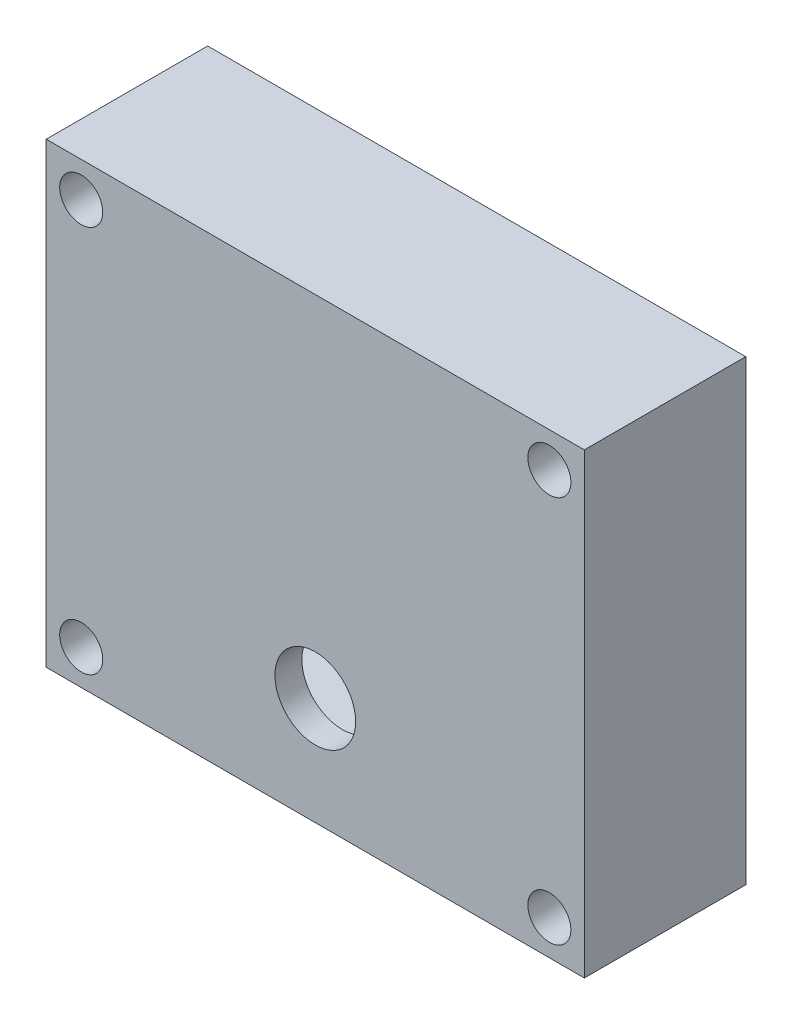
ISO-10303-21;
HEADER;
FILE_DESCRIPTION(('STEP AP214'),'2;1');
FILE_NAME('part.step','',(''),(''),'','','');
FILE_SCHEMA(('AUTOMOTIVE_DESIGN { 1 0 10303 214 1 1 1 1 }'));
ENDSEC;
DATA;
#1=APPLICATION_CONTEXT('core data for automotive mechanical design processes');
#2=APPLICATION_PROTOCOL_DEFINITION('international standard','automotive_design',2000,#1);
#3=PRODUCT_CONTEXT('',#1,'mechanical');
#4=PRODUCT('Part','Part','',(#3));
#5=PRODUCT_RELATED_PRODUCT_CATEGORY('part','',(#4));
#6=PRODUCT_DEFINITION_FORMATION('','',#4);
#7=PRODUCT_DEFINITION_CONTEXT('part definition',#1,'design');
#8=PRODUCT_DEFINITION('design','',#6,#7);
#9=PRODUCT_DEFINITION_SHAPE('','',#8);
#10=(LENGTH_UNIT() NAMED_UNIT(*) SI_UNIT(.MILLI.,.METRE.));
#11=(NAMED_UNIT(*) PLANE_ANGLE_UNIT() SI_UNIT($,.RADIAN.));
#12=(NAMED_UNIT(*) SI_UNIT($,.STERADIAN.) SOLID_ANGLE_UNIT());
#13=UNCERTAINTY_MEASURE_WITH_UNIT(LENGTH_MEASURE(1.E-05),#10,'distance_accuracy_value','');
#14=(GEOMETRIC_REPRESENTATION_CONTEXT(3) GLOBAL_UNCERTAINTY_ASSIGNED_CONTEXT((#13)) GLOBAL_UNIT_ASSIGNED_CONTEXT((#10,
#11,#12)) REPRESENTATION_CONTEXT('',''));
#15=CARTESIAN_POINT('',(0.,0.,0.));
#16=DIRECTION('',(0.,0.,1.));
#17=DIRECTION('',(1.,0.,0.));
#18=AXIS2_PLACEMENT_3D('',#15,#16,#17);
#19=CARTESIAN_POINT('',(-43.5,36.,-20.));
#20=DIRECTION('',(0.,0.,1.));
#21=DIRECTION('',(1.,0.,0.));
#22=AXIS2_PLACEMENT_3D('',#19,#20,#21);
#23=CYLINDRICAL_SURFACE('',#22,2.5);
#24=CARTESIAN_POINT('',(-43.5,36.,0.));
#25=DIRECTION('',(0.,0.,1.));
#26=DIRECTION('',(1.,0.,0.));
#27=AXIS2_PLACEMENT_3D('',#24,#25,#26);
#28=CIRCLE('',#27,2.5);
#29=CARTESIAN_POINT('',(-41.,36.,0.));
#30=VERTEX_POINT('',#29);
#31=EDGE_CURVE('E252',#30,#30,#28,.T.);
#32=ORIENTED_EDGE('',*,*,#31,.F.);
#33=EDGE_LOOP('',(#32));
#34=FACE_BOUND('',#33,.T.);
#35=CARTESIAN_POINT('',(-43.5,36.,10.));
#36=DIRECTION('',(0.,0.,1.));
#37=DIRECTION('',(1.,0.,0.));
#38=AXIS2_PLACEMENT_3D('',#35,#36,#37);
#39=CIRCLE('',#38,2.5);
#40=CARTESIAN_POINT('',(-41.,36.,10.));
#41=VERTEX_POINT('',#40);
#42=EDGE_CURVE('E256',#41,#41,#39,.F.);
#43=ORIENTED_EDGE('',*,*,#42,.F.);
#44=EDGE_LOOP('',(#43));
#45=FACE_BOUND('',#44,.T.);
#46=ADVANCED_FACE('F34',(#34,#45),#23,.F.);
#47=CARTESIAN_POINT('',(43.5,36.,-20.));
#48=DIRECTION('',(0.,0.,1.));
#49=DIRECTION('',(1.,0.,0.));
#50=AXIS2_PLACEMENT_3D('',#47,#48,#49);
#51=CYLINDRICAL_SURFACE('',#50,2.5);
#52=CARTESIAN_POINT('',(43.5,36.,0.));
#53=DIRECTION('',(0.,0.,1.));
#54=DIRECTION('',(1.,0.,0.));
#55=AXIS2_PLACEMENT_3D('',#52,#53,#54);
#56=CIRCLE('',#55,2.5);
#57=CARTESIAN_POINT('',(46.,36.,0.));
#58=VERTEX_POINT('',#57);
#59=EDGE_CURVE('E255',#58,#58,#56,.T.);
#60=ORIENTED_EDGE('',*,*,#59,.F.);
#61=EDGE_LOOP('',(#60));
#62=FACE_BOUND('',#61,.T.);
#63=CARTESIAN_POINT('',(43.5,36.,10.));
#64=DIRECTION('',(0.,0.,1.));
#65=DIRECTION('',(1.,0.,0.));
#66=AXIS2_PLACEMENT_3D('',#63,#64,#65);
#67=CIRCLE('',#66,2.5);
#68=CARTESIAN_POINT('',(46.,36.,10.));
#69=VERTEX_POINT('',#68);
#70=EDGE_CURVE('E269',#69,#69,#67,.F.);
#71=ORIENTED_EDGE('',*,*,#70,.F.);
#72=EDGE_LOOP('',(#71));
#73=FACE_BOUND('',#72,.T.);
#74=ADVANCED_FACE('F277',(#62,#73),#51,.F.);
#75=CARTESIAN_POINT('',(43.5,-36.,-20.));
#76=DIRECTION('',(0.,0.,1.));
#77=DIRECTION('',(1.,0.,0.));
#78=AXIS2_PLACEMENT_3D('',#75,#76,#77);
#79=CYLINDRICAL_SURFACE('',#78,2.5);
#80=CARTESIAN_POINT('',(43.5,-36.,0.));
#81=DIRECTION('',(0.,0.,1.));
#82=DIRECTION('',(1.,0.,0.));
#83=AXIS2_PLACEMENT_3D('',#80,#81,#82);
#84=CIRCLE('',#83,2.5);
#85=CARTESIAN_POINT('',(46.,-36.,0.));
#86=VERTEX_POINT('',#85);
#87=EDGE_CURVE('E259',#86,#86,#84,.T.);
#88=ORIENTED_EDGE('',*,*,#87,.F.);
#89=EDGE_LOOP('',(#88));
#90=FACE_BOUND('',#89,.T.);
#91=CARTESIAN_POINT('',(43.5,-36.,10.));
#92=DIRECTION('',(0.,0.,1.));
#93=DIRECTION('',(1.,0.,0.));
#94=AXIS2_PLACEMENT_3D('',#91,#92,#93);
#95=CIRCLE('',#94,2.5);
#96=CARTESIAN_POINT('',(46.,-36.,10.));
#97=VERTEX_POINT('',#96);
#98=EDGE_CURVE('E266',#97,#97,#95,.F.);
#99=ORIENTED_EDGE('',*,*,#98,.F.);
#100=EDGE_LOOP('',(#99));
#101=FACE_BOUND('',#100,.T.);
#102=ADVANCED_FACE('F283',(#90,#101),#79,.F.);
#103=CARTESIAN_POINT('',(-43.5,-36.,-20.));
#104=DIRECTION('',(0.,0.,1.));
#105=DIRECTION('',(1.,0.,0.));
#106=AXIS2_PLACEMENT_3D('',#103,#104,#105);
#107=CYLINDRICAL_SURFACE('',#106,2.5);
#108=CARTESIAN_POINT('',(-43.5,-36.,0.));
#109=DIRECTION('',(0.,0.,1.));
#110=DIRECTION('',(1.,0.,0.));
#111=AXIS2_PLACEMENT_3D('',#108,#109,#110);
#112=CIRCLE('',#111,2.5);
#113=CARTESIAN_POINT('',(-41.,-36.,0.));
#114=VERTEX_POINT('',#113);
#115=EDGE_CURVE('E242',#114,#114,#112,.T.);
#116=ORIENTED_EDGE('',*,*,#115,.F.);
#117=EDGE_LOOP('',(#116));
#118=FACE_BOUND('',#117,.T.);
#119=CARTESIAN_POINT('',(-43.5,-36.,10.));
#120=DIRECTION('',(0.,0.,1.));
#121=DIRECTION('',(1.,0.,0.));
#122=AXIS2_PLACEMENT_3D('',#119,#120,#121);
#123=CIRCLE('',#122,2.5);
#124=CARTESIAN_POINT('',(-41.,-36.,10.));
#125=VERTEX_POINT('',#124);
#126=EDGE_CURVE('E228',#125,#125,#123,.F.);
#127=ORIENTED_EDGE('',*,*,#126,.F.);
#128=EDGE_LOOP('',(#127));
#129=FACE_BOUND('',#128,.T.);
#130=ADVANCED_FACE('F289',(#118,#129),#107,.F.);
#131=CARTESIAN_POINT('',(50.,42.5,30.));
#132=DIRECTION('',(-1.,0.,0.));
#133=DIRECTION('',(0.,-1.,0.));
#134=AXIS2_PLACEMENT_3D('',#131,#132,#133);
#135=PLANE('',#134);
#136=DIRECTION('',(0.,1.,0.));
#137=VECTOR('',#136,1.);
#138=CARTESIAN_POINT('',(50.,42.5,0.));
#139=LINE('',#138,#137);
#140=CARTESIAN_POINT('',(50.,-42.5,0.));
#141=VERTEX_POINT('',#140);
#142=CARTESIAN_POINT('',(50.,42.5,0.));
#143=VERTEX_POINT('',#142);
#144=EDGE_CURVE('E238',#141,#143,#139,.T.);
#145=ORIENTED_EDGE('',*,*,#144,.T.);
#146=DIRECTION('',(0.,0.,-1.));
#147=VECTOR('',#146,1.);
#148=CARTESIAN_POINT('',(50.,42.5,30.));
#149=LINE('',#148,#147);
#150=CARTESIAN_POINT('',(50.,42.5,30.));
#151=VERTEX_POINT('',#150);
#152=EDGE_CURVE('E11',#151,#143,#149,.T.);
#153=ORIENTED_EDGE('',*,*,#152,.F.);
#154=DIRECTION('',(0.,1.,0.));
#155=VECTOR('',#154,1.);
#156=CARTESIAN_POINT('',(50.,42.5,30.));
#157=LINE('',#156,#155);
#158=CARTESIAN_POINT('',(50.,-42.5,30.));
#159=VERTEX_POINT('',#158);
#160=EDGE_CURVE('E231',#159,#151,#157,.T.);
#161=ORIENTED_EDGE('',*,*,#160,.F.);
#162=DIRECTION('',(0.,0.,-1.));
#163=VECTOR('',#162,1.);
#164=CARTESIAN_POINT('',(50.,-42.5,30.));
#165=LINE('',#164,#163);
#166=EDGE_CURVE('E237',#159,#141,#165,.T.);
#167=ORIENTED_EDGE('',*,*,#166,.T.);
#168=EDGE_LOOP('',(#145,#153,#161,#167));
#169=FACE_BOUND('',#168,.T.);
#170=ADVANCED_FACE('F36',(#169),#135,.F.);
#171=CARTESIAN_POINT('',(-50.,42.5,30.));
#172=DIRECTION('',(0.,-1.,0.));
#173=DIRECTION('',(0.,0.,-1.));
#174=AXIS2_PLACEMENT_3D('',#171,#172,#173);
#175=PLANE('',#174);
#176=DIRECTION('',(-1.,0.,0.));
#177=VECTOR('',#176,1.);
#178=CARTESIAN_POINT('',(-50.,42.5,0.));
#179=LINE('',#178,#177);
#180=CARTESIAN_POINT('',(-50.,42.5,0.));
#181=VERTEX_POINT('',#180);
#182=EDGE_CURVE('E241',#143,#181,#179,.T.);
#183=ORIENTED_EDGE('',*,*,#182,.T.);
#184=DIRECTION('',(0.,0.,-1.));
#185=VECTOR('',#184,1.);
#186=CARTESIAN_POINT('',(-50.,42.5,30.));
#187=LINE('',#186,#185);
#188=CARTESIAN_POINT('',(-50.,42.5,30.));
#189=VERTEX_POINT('',#188);
#190=EDGE_CURVE('E43',#189,#181,#187,.T.);
#191=ORIENTED_EDGE('',*,*,#190,.F.);
#192=DIRECTION('',(-1.,0.,0.));
#193=VECTOR('',#192,1.);
#194=CARTESIAN_POINT('',(-50.,42.5,30.));
#195=LINE('',#194,#193);
#196=EDGE_CURVE('E88',#151,#189,#195,.T.);
#197=ORIENTED_EDGE('',*,*,#196,.F.);
#198=ORIENTED_EDGE('',*,*,#152,.T.);
#199=EDGE_LOOP('',(#183,#191,#197,#198));
#200=FACE_BOUND('',#199,.T.);
#201=ADVANCED_FACE('F305',(#200),#175,.F.);
#202=CARTESIAN_POINT('',(-50.,42.5,30.));
#203=DIRECTION('',(1.,0.,0.));
#204=DIRECTION('',(0.,1.,0.));
#205=AXIS2_PLACEMENT_3D('',#202,#203,#204);
#206=PLANE('',#205);
#207=DIRECTION('',(0.,-1.,0.));
#208=VECTOR('',#207,1.);
#209=CARTESIAN_POINT('',(-50.,42.5,0.));
#210=LINE('',#209,#208);
#211=CARTESIAN_POINT('',(-50.,-42.5,0.));
#212=VERTEX_POINT('',#211);
#213=EDGE_CURVE('E244',#181,#212,#210,.T.);
#214=ORIENTED_EDGE('',*,*,#213,.T.);
#215=DIRECTION('',(0.,0.,-1.));
#216=VECTOR('',#215,1.);
#217=CARTESIAN_POINT('',(-50.,-42.5,30.));
#218=LINE('',#217,#216);
#219=CARTESIAN_POINT('',(-50.,-42.5,30.));
#220=VERTEX_POINT('',#219);
#221=EDGE_CURVE('E248',#220,#212,#218,.T.);
#222=ORIENTED_EDGE('',*,*,#221,.F.);
#223=DIRECTION('',(0.,-1.,0.));
#224=VECTOR('',#223,1.);
#225=CARTESIAN_POINT('',(-50.,42.5,30.));
#226=LINE('',#225,#224);
#227=EDGE_CURVE('E234',#189,#220,#226,.T.);
#228=ORIENTED_EDGE('',*,*,#227,.F.);
#229=ORIENTED_EDGE('',*,*,#190,.T.);
#230=EDGE_LOOP('',(#214,#222,#228,#229));
#231=FACE_BOUND('',#230,.T.);
#232=ADVANCED_FACE('F303',(#231),#206,.F.);
#233=CARTESIAN_POINT('',(-50.,-42.5,30.));
#234=DIRECTION('',(0.,1.,0.));
#235=DIRECTION('',(0.,0.,1.));
#236=AXIS2_PLACEMENT_3D('',#233,#234,#235);
#237=PLANE('',#236);
#238=DIRECTION('',(1.,0.,0.));
#239=VECTOR('',#238,1.);
#240=CARTESIAN_POINT('',(-50.,-42.5,0.));
#241=LINE('',#240,#239);
#242=EDGE_CURVE('E81',#212,#141,#241,.T.);
#243=ORIENTED_EDGE('',*,*,#242,.T.);
#244=ORIENTED_EDGE('',*,*,#166,.F.);
#245=DIRECTION('',(1.,0.,0.));
#246=VECTOR('',#245,1.);
#247=CARTESIAN_POINT('',(-50.,-42.5,30.));
#248=LINE('',#247,#246);
#249=EDGE_CURVE('E60',#220,#159,#248,.T.);
#250=ORIENTED_EDGE('',*,*,#249,.F.);
#251=ORIENTED_EDGE('',*,*,#221,.T.);
#252=EDGE_LOOP('',(#243,#244,#250,#251));
#253=FACE_BOUND('',#252,.T.);
#254=ADVANCED_FACE('F295',(#253),#237,.F.);
#255=CARTESIAN_POINT('',(0.,0.,30.));
#256=DIRECTION('',(0.,0.,1.));
#257=DIRECTION('',(1.,0.,0.));
#258=AXIS2_PLACEMENT_3D('',#255,#256,#257);
#259=PLANE('',#258);
#260=CARTESIAN_POINT('',(0.,-22.5,30.));
#261=DIRECTION('',(0.,0.,1.));
#262=DIRECTION('',(1.,0.,0.));
#263=AXIS2_PLACEMENT_3D('',#260,#261,#262);
#264=CIRCLE('',#263,7.5);
#265=CARTESIAN_POINT('',(7.50000000000001,-22.5,30.));
#266=VERTEX_POINT('',#265);
#267=EDGE_CURVE('E161',#266,#266,#264,.T.);
#268=ORIENTED_EDGE('',*,*,#267,.F.);
#269=EDGE_LOOP('',(#268));
#270=FACE_BOUND('',#269,.T.);
#271=CARTESIAN_POINT('',(43.5,36.,30.));
#272=DIRECTION('',(0.,0.,1.));
#273=DIRECTION('',(1.,0.,0.));
#274=AXIS2_PLACEMENT_3D('',#271,#272,#273);
#275=CIRCLE('',#274,4.);
#276=CARTESIAN_POINT('',(47.5,36.,30.));
#277=VERTEX_POINT('',#276);
#278=EDGE_CURVE('E217',#277,#277,#275,.T.);
#279=ORIENTED_EDGE('',*,*,#278,.F.);
#280=EDGE_LOOP('',(#279));
#281=FACE_BOUND('',#280,.T.);
#282=CARTESIAN_POINT('',(-43.5,-36.,30.));
#283=DIRECTION('',(0.,0.,1.));
#284=DIRECTION('',(1.,0.,0.));
#285=AXIS2_PLACEMENT_3D('',#282,#283,#284);
#286=CIRCLE('',#285,4.);
#287=CARTESIAN_POINT('',(-39.5,-36.,30.));
#288=VERTEX_POINT('',#287);
#289=EDGE_CURVE('E210',#288,#288,#286,.T.);
#290=ORIENTED_EDGE('',*,*,#289,.F.);
#291=EDGE_LOOP('',(#290));
#292=FACE_BOUND('',#291,.T.);
#293=CARTESIAN_POINT('',(43.5,-36.,30.));
#294=DIRECTION('',(0.,0.,1.));
#295=DIRECTION('',(1.,0.,0.));
#296=AXIS2_PLACEMENT_3D('',#293,#294,#295);
#297=CIRCLE('',#296,4.);
#298=CARTESIAN_POINT('',(47.5,-36.,30.));
#299=VERTEX_POINT('',#298);
#300=EDGE_CURVE('E195',#299,#299,#297,.T.);
#301=ORIENTED_EDGE('',*,*,#300,.F.);
#302=EDGE_LOOP('',(#301));
#303=FACE_BOUND('',#302,.T.);
#304=CARTESIAN_POINT('',(-43.5,36.,30.));
#305=DIRECTION('',(0.,0.,1.));
#306=DIRECTION('',(1.,0.,0.));
#307=AXIS2_PLACEMENT_3D('',#304,#305,#306);
#308=CIRCLE('',#307,4.);
#309=CARTESIAN_POINT('',(-39.5,36.,30.));
#310=VERTEX_POINT('',#309);
#311=EDGE_CURVE('E216',#310,#310,#308,.T.);
#312=ORIENTED_EDGE('',*,*,#311,.F.);
#313=EDGE_LOOP('',(#312));
#314=FACE_BOUND('',#313,.T.);
#315=ORIENTED_EDGE('',*,*,#160,.T.);
#316=ORIENTED_EDGE('',*,*,#196,.T.);
#317=ORIENTED_EDGE('',*,*,#227,.T.);
#318=ORIENTED_EDGE('',*,*,#249,.T.);
#319=EDGE_LOOP('',(#315,#316,#317,#318));
#320=FACE_BOUND('',#319,.T.);
#321=ADVANCED_FACE('F291',(#270,#281,#292,#303,#314,#320),#259,.T.);
#322=CARTESIAN_POINT('',(0.,0.,0.));
#323=DIRECTION('',(0.,0.,1.));
#324=DIRECTION('',(1.,0.,0.));
#325=AXIS2_PLACEMENT_3D('',#322,#323,#324);
#326=PLANE('',#325);
#327=DIRECTION('',(-1.,0.,0.));
#328=VECTOR('',#327,1.);
#329=CARTESIAN_POINT('',(32.,-37.,0.));
#330=LINE('',#329,#328);
#331=CARTESIAN_POINT('',(32.,-37.,0.));
#332=VERTEX_POINT('',#331);
#333=CARTESIAN_POINT('',(-32.,-37.,0.));
#334=VERTEX_POINT('',#333);
#335=EDGE_CURVE('E177',#332,#334,#330,.T.);
#336=ORIENTED_EDGE('',*,*,#335,.F.);
#337=CARTESIAN_POINT('',(32.,-27.,0.));
#338=DIRECTION('',(0.,0.,-1.));
#339=DIRECTION('',(-1.,0.,0.));
#340=AXIS2_PLACEMENT_3D('',#337,#338,#339);
#341=CIRCLE('',#340,10.);
#342=CARTESIAN_POINT('',(42.,-27.,0.));
#343=VERTEX_POINT('',#342);
#344=EDGE_CURVE('E51',#343,#332,#341,.T.);
#345=ORIENTED_EDGE('',*,*,#344,.F.);
#346=DIRECTION('',(0.,-1.,0.));
#347=VECTOR('',#346,1.);
#348=CARTESIAN_POINT('',(42.,27.,0.));
#349=LINE('',#348,#347);
#350=CARTESIAN_POINT('',(42.,27.,0.));
#351=VERTEX_POINT('',#350);
#352=EDGE_CURVE('E155',#351,#343,#349,.T.);
#353=ORIENTED_EDGE('',*,*,#352,.F.);
#354=CARTESIAN_POINT('',(32.,27.,0.));
#355=DIRECTION('',(0.,0.,-1.));
#356=DIRECTION('',(-1.,0.,0.));
#357=AXIS2_PLACEMENT_3D('',#354,#355,#356);
#358=CIRCLE('',#357,10.);
#359=CARTESIAN_POINT('',(32.,37.,0.));
#360=VERTEX_POINT('',#359);
#361=EDGE_CURVE('E158',#360,#351,#358,.T.);
#362=ORIENTED_EDGE('',*,*,#361,.F.);
#363=DIRECTION('',(1.,0.,0.));
#364=VECTOR('',#363,1.);
#365=CARTESIAN_POINT('',(32.,37.,0.));
#366=LINE('',#365,#364);
#367=CARTESIAN_POINT('',(-32.,37.,0.));
#368=VERTEX_POINT('',#367);
#369=EDGE_CURVE('E188',#368,#360,#366,.T.);
#370=ORIENTED_EDGE('',*,*,#369,.F.);
#371=CARTESIAN_POINT('',(-32.,27.,0.));
#372=DIRECTION('',(0.,0.,-1.));
#373=DIRECTION('',(1.,0.,0.));
#374=AXIS2_PLACEMENT_3D('',#371,#372,#373);
#375=CIRCLE('',#374,10.);
#376=CARTESIAN_POINT('',(-42.,27.,0.));
#377=VERTEX_POINT('',#376);
#378=EDGE_CURVE('E185',#377,#368,#375,.T.);
#379=ORIENTED_EDGE('',*,*,#378,.F.);
#380=DIRECTION('',(0.,1.,0.));
#381=VECTOR('',#380,1.);
#382=CARTESIAN_POINT('',(-42.,27.,0.));
#383=LINE('',#382,#381);
#384=CARTESIAN_POINT('',(-42.,-27.,0.));
#385=VERTEX_POINT('',#384);
#386=EDGE_CURVE('E182',#385,#377,#383,.T.);
#387=ORIENTED_EDGE('',*,*,#386,.F.);
#388=CARTESIAN_POINT('',(-32.,-27.,0.));
#389=DIRECTION('',(0.,0.,-1.));
#390=DIRECTION('',(-1.,0.,0.));
#391=AXIS2_PLACEMENT_3D('',#388,#389,#390);
#392=CIRCLE('',#391,10.);
#393=EDGE_CURVE('E179',#334,#385,#392,.T.);
#394=ORIENTED_EDGE('',*,*,#393,.F.);
#395=EDGE_LOOP('',(#336,#345,#353,#362,#370,#379,#387,#394));
#396=FACE_BOUND('',#395,.T.);
#397=ORIENTED_EDGE('',*,*,#115,.T.);
#398=EDGE_LOOP('',(#397));
#399=FACE_BOUND('',#398,.T.);
#400=ORIENTED_EDGE('',*,*,#87,.T.);
#401=EDGE_LOOP('',(#400));
#402=FACE_BOUND('',#401,.T.);
#403=ORIENTED_EDGE('',*,*,#59,.T.);
#404=EDGE_LOOP('',(#403));
#405=FACE_BOUND('',#404,.T.);
#406=ORIENTED_EDGE('',*,*,#31,.T.);
#407=EDGE_LOOP('',(#406));
#408=FACE_BOUND('',#407,.T.);
#409=ORIENTED_EDGE('',*,*,#144,.F.);
#410=ORIENTED_EDGE('',*,*,#242,.F.);
#411=ORIENTED_EDGE('',*,*,#213,.F.);
#412=ORIENTED_EDGE('',*,*,#182,.F.);
#413=EDGE_LOOP('',(#409,#410,#411,#412));
#414=FACE_BOUND('',#413,.T.);
#415=ADVANCED_FACE('F294',(#396,#399,#402,#405,#408,#414),#326,.F.);
#416=CARTESIAN_POINT('',(-43.5,-36.,10.));
#417=DIRECTION('',(0.,0.,1.));
#418=DIRECTION('',(1.,0.,0.));
#419=AXIS2_PLACEMENT_3D('',#416,#417,#418);
#420=PLANE('',#419);
#421=CARTESIAN_POINT('',(-43.5,-36.,10.));
#422=DIRECTION('',(0.,0.,1.));
#423=DIRECTION('',(1.,0.,0.));
#424=AXIS2_PLACEMENT_3D('',#421,#422,#423);
#425=CIRCLE('',#424,4.);
#426=CARTESIAN_POINT('',(-39.5,-36.,10.));
#427=VERTEX_POINT('',#426);
#428=EDGE_CURVE('E220',#427,#427,#425,.T.);
#429=ORIENTED_EDGE('',*,*,#428,.T.);
#430=EDGE_LOOP('',(#429));
#431=FACE_BOUND('',#430,.T.);
#432=ORIENTED_EDGE('',*,*,#126,.T.);
#433=EDGE_LOOP('',(#432));
#434=FACE_BOUND('',#433,.T.);
#435=ADVANCED_FACE('F299',(#431,#434),#420,.T.);
#436=CARTESIAN_POINT('',(-43.5,-36.,10.));
#437=DIRECTION('',(0.,0.,1.));
#438=DIRECTION('',(1.,0.,0.));
#439=AXIS2_PLACEMENT_3D('',#436,#437,#438);
#440=CYLINDRICAL_SURFACE('',#439,4.);
#441=ORIENTED_EDGE('',*,*,#428,.F.);
#442=EDGE_LOOP('',(#441));
#443=FACE_BOUND('',#442,.T.);
#444=ORIENTED_EDGE('',*,*,#289,.T.);
#445=EDGE_LOOP('',(#444));
#446=FACE_BOUND('',#445,.T.);
#447=ADVANCED_FACE('F332',(#443,#446),#440,.F.);
#448=CARTESIAN_POINT('',(43.5,-36.,10.));
#449=DIRECTION('',(0.,0.,1.));
#450=DIRECTION('',(1.,0.,0.));
#451=AXIS2_PLACEMENT_3D('',#448,#449,#450);
#452=PLANE('',#451);
#453=CARTESIAN_POINT('',(43.5,-36.,10.));
#454=DIRECTION('',(0.,0.,1.));
#455=DIRECTION('',(1.,0.,0.));
#456=AXIS2_PLACEMENT_3D('',#453,#454,#455);
#457=CIRCLE('',#456,4.);
#458=CARTESIAN_POINT('',(47.5,-36.,10.));
#459=VERTEX_POINT('',#458);
#460=EDGE_CURVE('E207',#459,#459,#457,.T.);
#461=ORIENTED_EDGE('',*,*,#460,.T.);
#462=EDGE_LOOP('',(#461));
#463=FACE_BOUND('',#462,.T.);
#464=ORIENTED_EDGE('',*,*,#98,.T.);
#465=EDGE_LOOP('',(#464));
#466=FACE_BOUND('',#465,.T.);
#467=ADVANCED_FACE('F338',(#463,#466),#452,.T.);
#468=CARTESIAN_POINT('',(43.5,-36.,10.));
#469=DIRECTION('',(0.,0.,1.));
#470=DIRECTION('',(1.,0.,0.));
#471=AXIS2_PLACEMENT_3D('',#468,#469,#470);
#472=CYLINDRICAL_SURFACE('',#471,4.);
#473=ORIENTED_EDGE('',*,*,#460,.F.);
#474=EDGE_LOOP('',(#473));
#475=FACE_BOUND('',#474,.T.);
#476=ORIENTED_EDGE('',*,*,#300,.T.);
#477=EDGE_LOOP('',(#476));
#478=FACE_BOUND('',#477,.T.);
#479=ADVANCED_FACE('F371',(#475,#478),#472,.F.);
#480=CARTESIAN_POINT('',(43.5,36.,10.));
#481=DIRECTION('',(0.,0.,1.));
#482=DIRECTION('',(1.,0.,0.));
#483=AXIS2_PLACEMENT_3D('',#480,#481,#482);
#484=PLANE('',#483);
#485=CARTESIAN_POINT('',(43.5,36.,10.));
#486=DIRECTION('',(0.,0.,1.));
#487=DIRECTION('',(1.,0.,0.));
#488=AXIS2_PLACEMENT_3D('',#485,#486,#487);
#489=CIRCLE('',#488,4.);
#490=CARTESIAN_POINT('',(47.5,36.,10.));
#491=VERTEX_POINT('',#490);
#492=EDGE_CURVE('E213',#491,#491,#489,.T.);
#493=ORIENTED_EDGE('',*,*,#492,.T.);
#494=EDGE_LOOP('',(#493));
#495=FACE_BOUND('',#494,.T.);
#496=ORIENTED_EDGE('',*,*,#70,.T.);
#497=EDGE_LOOP('',(#496));
#498=FACE_BOUND('',#497,.T.);
#499=ADVANCED_FACE('F374',(#495,#498),#484,.T.);
#500=CARTESIAN_POINT('',(43.5,36.,10.));
#501=DIRECTION('',(0.,0.,1.));
#502=DIRECTION('',(1.,0.,0.));
#503=AXIS2_PLACEMENT_3D('',#500,#501,#502);
#504=CYLINDRICAL_SURFACE('',#503,4.);
#505=ORIENTED_EDGE('',*,*,#492,.F.);
#506=EDGE_LOOP('',(#505));
#507=FACE_BOUND('',#506,.T.);
#508=ORIENTED_EDGE('',*,*,#278,.T.);
#509=EDGE_LOOP('',(#508));
#510=FACE_BOUND('',#509,.T.);
#511=ADVANCED_FACE('F342',(#507,#510),#504,.F.);
#512=CARTESIAN_POINT('',(-43.5,36.,10.));
#513=DIRECTION('',(0.,0.,1.));
#514=DIRECTION('',(1.,0.,0.));
#515=AXIS2_PLACEMENT_3D('',#512,#513,#514);
#516=PLANE('',#515);
#517=CARTESIAN_POINT('',(-43.5,36.,10.));
#518=DIRECTION('',(0.,0.,1.));
#519=DIRECTION('',(1.,0.,0.));
#520=AXIS2_PLACEMENT_3D('',#517,#518,#519);
#521=CIRCLE('',#520,4.);
#522=CARTESIAN_POINT('',(-39.5,36.,10.));
#523=VERTEX_POINT('',#522);
#524=EDGE_CURVE('E225',#523,#523,#521,.T.);
#525=ORIENTED_EDGE('',*,*,#524,.T.);
#526=EDGE_LOOP('',(#525));
#527=FACE_BOUND('',#526,.T.);
#528=ORIENTED_EDGE('',*,*,#42,.T.);
#529=EDGE_LOOP('',(#528));
#530=FACE_BOUND('',#529,.T.);
#531=ADVANCED_FACE('F274',(#527,#530),#516,.T.);
#532=CARTESIAN_POINT('',(-43.5,36.,10.));
#533=DIRECTION('',(0.,0.,1.));
#534=DIRECTION('',(1.,0.,0.));
#535=AXIS2_PLACEMENT_3D('',#532,#533,#534);
#536=CYLINDRICAL_SURFACE('',#535,4.);
#537=ORIENTED_EDGE('',*,*,#524,.F.);
#538=EDGE_LOOP('',(#537));
#539=FACE_BOUND('',#538,.T.);
#540=ORIENTED_EDGE('',*,*,#311,.T.);
#541=EDGE_LOOP('',(#540));
#542=FACE_BOUND('',#541,.T.);
#543=ADVANCED_FACE('F347',(#539,#542),#536,.F.);
#544=CARTESIAN_POINT('',(32.,-27.,25.));
#545=DIRECTION('',(0.,0.,-1.));
#546=DIRECTION('',(-1.,0.,0.));
#547=AXIS2_PLACEMENT_3D('',#544,#545,#546);
#548=CYLINDRICAL_SURFACE('',#547,10.);
#549=ORIENTED_EDGE('',*,*,#344,.T.);
#550=DIRECTION('',(0.,0.,-1.));
#551=VECTOR('',#550,1.);
#552=CARTESIAN_POINT('',(32.,-37.,25.));
#553=LINE('',#552,#551);
#554=CARTESIAN_POINT('',(32.,-37.,25.));
#555=VERTEX_POINT('',#554);
#556=EDGE_CURVE('E132',#555,#332,#553,.T.);
#557=ORIENTED_EDGE('',*,*,#556,.F.);
#558=CARTESIAN_POINT('',(32.,-27.,25.));
#559=DIRECTION('',(0.,0.,-1.));
#560=DIRECTION('',(-1.,0.,0.));
#561=AXIS2_PLACEMENT_3D('',#558,#559,#560);
#562=CIRCLE('',#561,10.);
#563=CARTESIAN_POINT('',(42.,-27.,25.));
#564=VERTEX_POINT('',#563);
#565=EDGE_CURVE('E136',#564,#555,#562,.T.);
#566=ORIENTED_EDGE('',*,*,#565,.F.);
#567=DIRECTION('',(0.,0.,-1.));
#568=VECTOR('',#567,1.);
#569=CARTESIAN_POINT('',(42.,-27.,25.));
#570=LINE('',#569,#568);
#571=EDGE_CURVE('E193',#564,#343,#570,.T.);
#572=ORIENTED_EDGE('',*,*,#571,.T.);
#573=EDGE_LOOP('',(#549,#557,#566,#572));
#574=FACE_BOUND('',#573,.T.);
#575=ADVANCED_FACE('F134',(#574),#548,.F.);
#576=CARTESIAN_POINT('',(42.,27.,25.));
#577=DIRECTION('',(1.,0.,0.));
#578=DIRECTION('',(0.,0.,-1.));
#579=AXIS2_PLACEMENT_3D('',#576,#577,#578);
#580=PLANE('',#579);
#581=ORIENTED_EDGE('',*,*,#352,.T.);
#582=ORIENTED_EDGE('',*,*,#571,.F.);
#583=DIRECTION('',(0.,-1.,0.));
#584=VECTOR('',#583,1.);
#585=CARTESIAN_POINT('',(42.,27.,25.));
#586=LINE('',#585,#584);
#587=CARTESIAN_POINT('',(42.,27.,25.));
#588=VERTEX_POINT('',#587);
#589=EDGE_CURVE('E142',#588,#564,#586,.T.);
#590=ORIENTED_EDGE('',*,*,#589,.F.);
#591=DIRECTION('',(0.,0.,-1.));
#592=VECTOR('',#591,1.);
#593=CARTESIAN_POINT('',(42.,27.,25.));
#594=LINE('',#593,#592);
#595=EDGE_CURVE('E196',#588,#351,#594,.T.);
#596=ORIENTED_EDGE('',*,*,#595,.T.);
#597=EDGE_LOOP('',(#581,#582,#590,#596));
#598=FACE_BOUND('',#597,.T.);
#599=ADVANCED_FACE('F354',(#598),#580,.F.);
#600=CARTESIAN_POINT('',(32.,27.,25.));
#601=DIRECTION('',(0.,0.,-1.));
#602=DIRECTION('',(-1.,0.,0.));
#603=AXIS2_PLACEMENT_3D('',#600,#601,#602);
#604=CYLINDRICAL_SURFACE('',#603,10.);
#605=ORIENTED_EDGE('',*,*,#361,.T.);
#606=ORIENTED_EDGE('',*,*,#595,.F.);
#607=CARTESIAN_POINT('',(32.,27.,25.));
#608=DIRECTION('',(0.,0.,-1.));
#609=DIRECTION('',(-1.,0.,0.));
#610=AXIS2_PLACEMENT_3D('',#607,#608,#609);
#611=CIRCLE('',#610,10.);
#612=CARTESIAN_POINT('',(32.,37.,25.));
#613=VERTEX_POINT('',#612);
#614=EDGE_CURVE('E173',#613,#588,#611,.T.);
#615=ORIENTED_EDGE('',*,*,#614,.F.);
#616=DIRECTION('',(0.,0.,-1.));
#617=VECTOR('',#616,1.);
#618=CARTESIAN_POINT('',(32.,37.,25.));
#619=LINE('',#618,#617);
#620=EDGE_CURVE('E198',#613,#360,#619,.T.);
#621=ORIENTED_EDGE('',*,*,#620,.T.);
#622=EDGE_LOOP('',(#605,#606,#615,#621));
#623=FACE_BOUND('',#622,.T.);
#624=ADVANCED_FACE('F363',(#623),#604,.F.);
#625=CARTESIAN_POINT('',(32.,37.,25.));
#626=DIRECTION('',(0.,1.,0.));
#627=DIRECTION('',(0.,0.,1.));
#628=AXIS2_PLACEMENT_3D('',#625,#626,#627);
#629=PLANE('',#628);
#630=ORIENTED_EDGE('',*,*,#369,.T.);
#631=ORIENTED_EDGE('',*,*,#620,.F.);
#632=DIRECTION('',(1.,0.,0.));
#633=VECTOR('',#632,1.);
#634=CARTESIAN_POINT('',(32.,37.,25.));
#635=LINE('',#634,#633);
#636=CARTESIAN_POINT('',(-32.,37.,25.));
#637=VERTEX_POINT('',#636);
#638=EDGE_CURVE('E170',#637,#613,#635,.T.);
#639=ORIENTED_EDGE('',*,*,#638,.F.);
#640=DIRECTION('',(0.,0.,-1.));
#641=VECTOR('',#640,1.);
#642=CARTESIAN_POINT('',(-32.,37.,25.));
#643=LINE('',#642,#641);
#644=EDGE_CURVE('E200',#637,#368,#643,.T.);
#645=ORIENTED_EDGE('',*,*,#644,.T.);
#646=EDGE_LOOP('',(#630,#631,#639,#645));
#647=FACE_BOUND('',#646,.T.);
#648=ADVANCED_FACE('F432',(#647),#629,.F.);
#649=CARTESIAN_POINT('',(-32.,27.,25.));
#650=DIRECTION('',(0.,0.,-1.));
#651=DIRECTION('',(-1.,0.,0.));
#652=AXIS2_PLACEMENT_3D('',#649,#650,#651);
#653=CYLINDRICAL_SURFACE('',#652,10.);
#654=ORIENTED_EDGE('',*,*,#378,.T.);
#655=ORIENTED_EDGE('',*,*,#644,.F.);
#656=CARTESIAN_POINT('',(-32.,27.,25.));
#657=DIRECTION('',(0.,0.,-1.));
#658=DIRECTION('',(1.,0.,0.));
#659=AXIS2_PLACEMENT_3D('',#656,#657,#658);
#660=CIRCLE('',#659,10.);
#661=CARTESIAN_POINT('',(-42.,27.,25.));
#662=VERTEX_POINT('',#661);
#663=EDGE_CURVE('E167',#662,#637,#660,.T.);
#664=ORIENTED_EDGE('',*,*,#663,.F.);
#665=DIRECTION('',(0.,0.,-1.));
#666=VECTOR('',#665,1.);
#667=CARTESIAN_POINT('',(-42.,27.,25.));
#668=LINE('',#667,#666);
#669=EDGE_CURVE('E202',#662,#377,#668,.T.);
#670=ORIENTED_EDGE('',*,*,#669,.T.);
#671=EDGE_LOOP('',(#654,#655,#664,#670));
#672=FACE_BOUND('',#671,.T.);
#673=ADVANCED_FACE('F442',(#672),#653,.F.);
#674=CARTESIAN_POINT('',(-42.,27.,25.));
#675=DIRECTION('',(-1.,0.,0.));
#676=DIRECTION('',(0.,-1.,0.));
#677=AXIS2_PLACEMENT_3D('',#674,#675,#676);
#678=PLANE('',#677);
#679=ORIENTED_EDGE('',*,*,#386,.T.);
#680=ORIENTED_EDGE('',*,*,#669,.F.);
#681=DIRECTION('',(0.,1.,0.));
#682=VECTOR('',#681,1.);
#683=CARTESIAN_POINT('',(-42.,27.,25.));
#684=LINE('',#683,#682);
#685=CARTESIAN_POINT('',(-42.,-27.,25.));
#686=VERTEX_POINT('',#685);
#687=EDGE_CURVE('E164',#686,#662,#684,.T.);
#688=ORIENTED_EDGE('',*,*,#687,.F.);
#689=DIRECTION('',(0.,0.,-1.));
#690=VECTOR('',#689,1.);
#691=CARTESIAN_POINT('',(-42.,-27.,25.));
#692=LINE('',#691,#690);
#693=EDGE_CURVE('E204',#686,#385,#692,.T.);
#694=ORIENTED_EDGE('',*,*,#693,.T.);
#695=EDGE_LOOP('',(#679,#680,#688,#694));
#696=FACE_BOUND('',#695,.T.);
#697=ADVANCED_FACE('F452',(#696),#678,.F.);
#698=CARTESIAN_POINT('',(-32.,-27.,25.));
#699=DIRECTION('',(0.,0.,-1.));
#700=DIRECTION('',(-1.,0.,0.));
#701=AXIS2_PLACEMENT_3D('',#698,#699,#700);
#702=CYLINDRICAL_SURFACE('',#701,10.);
#703=ORIENTED_EDGE('',*,*,#393,.T.);
#704=ORIENTED_EDGE('',*,*,#693,.F.);
#705=CARTESIAN_POINT('',(-32.,-27.,25.));
#706=DIRECTION('',(0.,0.,-1.));
#707=DIRECTION('',(-1.,0.,0.));
#708=AXIS2_PLACEMENT_3D('',#705,#706,#707);
#709=CIRCLE('',#708,10.);
#710=CARTESIAN_POINT('',(-32.,-37.,25.));
#711=VERTEX_POINT('',#710);
#712=EDGE_CURVE('E150',#711,#686,#709,.T.);
#713=ORIENTED_EDGE('',*,*,#712,.F.);
#714=DIRECTION('',(0.,0.,-1.));
#715=VECTOR('',#714,1.);
#716=CARTESIAN_POINT('',(-32.,-37.,25.));
#717=LINE('',#716,#715);
#718=EDGE_CURVE('E141',#711,#334,#717,.T.);
#719=ORIENTED_EDGE('',*,*,#718,.T.);
#720=EDGE_LOOP('',(#703,#704,#713,#719));
#721=FACE_BOUND('',#720,.T.);
#722=ADVANCED_FACE('F462',(#721),#702,.F.);
#723=CARTESIAN_POINT('',(32.,-37.,25.));
#724=DIRECTION('',(0.,-1.,0.));
#725=DIRECTION('',(0.,0.,-1.));
#726=AXIS2_PLACEMENT_3D('',#723,#724,#725);
#727=PLANE('',#726);
#728=ORIENTED_EDGE('',*,*,#335,.T.);
#729=ORIENTED_EDGE('',*,*,#718,.F.);
#730=DIRECTION('',(-1.,0.,0.));
#731=VECTOR('',#730,1.);
#732=CARTESIAN_POINT('',(32.,-37.,25.));
#733=LINE('',#732,#731);
#734=EDGE_CURVE('E145',#555,#711,#733,.T.);
#735=ORIENTED_EDGE('',*,*,#734,.F.);
#736=ORIENTED_EDGE('',*,*,#556,.T.);
#737=EDGE_LOOP('',(#728,#729,#735,#736));
#738=FACE_BOUND('',#737,.T.);
#739=ADVANCED_FACE('F146',(#738),#727,.F.);
#740=CARTESIAN_POINT('',(32.,-27.,25.));
#741=DIRECTION('',(0.,0.,-1.));
#742=DIRECTION('',(-1.,0.,0.));
#743=AXIS2_PLACEMENT_3D('',#740,#741,#742);
#744=PLANE('',#743);
#745=CARTESIAN_POINT('',(0.,-22.5,25.));
#746=DIRECTION('',(0.,0.,-1.));
#747=DIRECTION('',(-1.,0.,0.));
#748=AXIS2_PLACEMENT_3D('',#745,#746,#747);
#749=CIRCLE('',#748,7.5);
#750=CARTESIAN_POINT('',(-7.49999999999999,-22.5,25.));
#751=VERTEX_POINT('',#750);
#752=EDGE_CURVE('E38',#751,#751,#749,.T.);
#753=ORIENTED_EDGE('',*,*,#752,.F.);
#754=EDGE_LOOP('',(#753));
#755=FACE_BOUND('',#754,.T.);
#756=ORIENTED_EDGE('',*,*,#565,.T.);
#757=ORIENTED_EDGE('',*,*,#734,.T.);
#758=ORIENTED_EDGE('',*,*,#712,.T.);
#759=ORIENTED_EDGE('',*,*,#687,.T.);
#760=ORIENTED_EDGE('',*,*,#663,.T.);
#761=ORIENTED_EDGE('',*,*,#638,.T.);
#762=ORIENTED_EDGE('',*,*,#614,.T.);
#763=ORIENTED_EDGE('',*,*,#589,.T.);
#764=EDGE_LOOP('',(#756,#757,#758,#759,#760,#761,#762,#763));
#765=FACE_BOUND('',#764,.T.);
#766=ADVANCED_FACE('F152',(#755,#765),#744,.T.);
#767=CARTESIAN_POINT('',(0.,-22.5,0.));
#768=DIRECTION('',(0.,0.,1.));
#769=DIRECTION('',(1.,0.,0.));
#770=AXIS2_PLACEMENT_3D('',#767,#768,#769);
#771=CYLINDRICAL_SURFACE('',#770,7.5);
#772=ORIENTED_EDGE('',*,*,#752,.T.);
#773=EDGE_LOOP('',(#772));
#774=FACE_BOUND('',#773,.T.);
#775=ORIENTED_EDGE('',*,*,#267,.T.);
#776=EDGE_LOOP('',(#775));
#777=FACE_BOUND('',#776,.T.);
#778=ADVANCED_FACE('F493',(#774,#777),#771,.F.);
#779=CLOSED_SHELL('',(#46,#74,#102,#130,#170,#201,#232,#254,#321,#415,#435,#447,#467,#479,#499,
#511,#531,#543,#575,#599,#624,#648,#673,#697,#722,#739,#766,#778));
#780=MANIFOLD_SOLID_BREP('B2',#779);
#781=ADVANCED_BREP_SHAPE_REPRESENTATION('',(#18,#780),#14);
#782=SHAPE_DEFINITION_REPRESENTATION(#9,#781);
ENDSEC;
END-ISO-10303-21;
